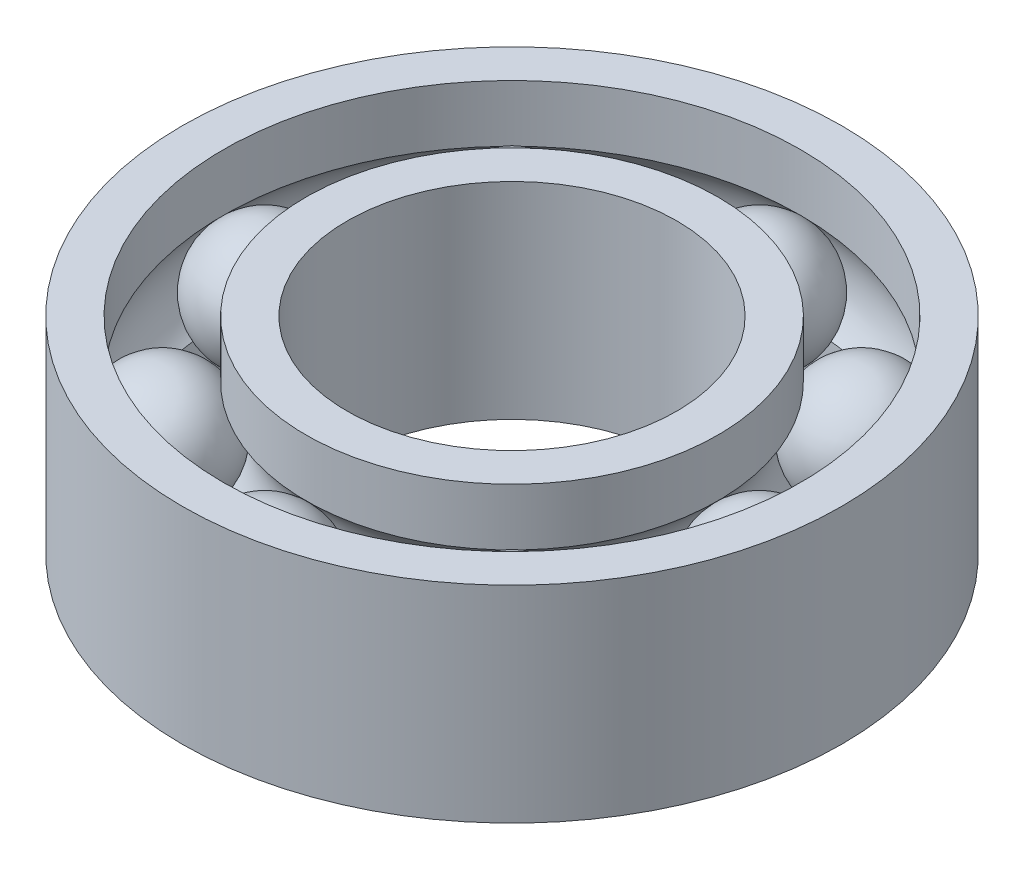
ISO-10303-21;
HEADER;
FILE_DESCRIPTION(('STEP AP214'),'2;1');
FILE_NAME('part.step','',(''),(''),'','','');
FILE_SCHEMA(('AUTOMOTIVE_DESIGN { 1 0 10303 214 1 1 1 1 }'));
ENDSEC;
DATA;
#1=APPLICATION_CONTEXT('core data for automotive mechanical design processes');
#2=APPLICATION_PROTOCOL_DEFINITION('international standard','automotive_design',2000,#1);
#3=PRODUCT_CONTEXT('',#1,'mechanical');
#4=PRODUCT('Part','Part','',(#3));
#5=PRODUCT_RELATED_PRODUCT_CATEGORY('part','',(#4));
#6=PRODUCT_DEFINITION_FORMATION('','',#4);
#7=PRODUCT_DEFINITION_CONTEXT('part definition',#1,'design');
#8=PRODUCT_DEFINITION('design','',#6,#7);
#9=PRODUCT_DEFINITION_SHAPE('','',#8);
#10=(LENGTH_UNIT() NAMED_UNIT(*) SI_UNIT(.MILLI.,.METRE.));
#11=(NAMED_UNIT(*) PLANE_ANGLE_UNIT() SI_UNIT($,.RADIAN.));
#12=(NAMED_UNIT(*) SI_UNIT($,.STERADIAN.) SOLID_ANGLE_UNIT());
#13=UNCERTAINTY_MEASURE_WITH_UNIT(LENGTH_MEASURE(1.E-05),#10,'distance_accuracy_value','');
#14=(GEOMETRIC_REPRESENTATION_CONTEXT(3) GLOBAL_UNCERTAINTY_ASSIGNED_CONTEXT((#13)) GLOBAL_UNIT_ASSIGNED_CONTEXT((#10,
#11,#12)) REPRESENTATION_CONTEXT('',''));
#15=CARTESIAN_POINT('',(0.,0.,0.));
#16=DIRECTION('',(0.,0.,1.));
#17=DIRECTION('',(1.,0.,0.));
#18=AXIS2_PLACEMENT_3D('',#15,#16,#17);
#19=CARTESIAN_POINT('',(-6.363961030679,0.,-6.36396103067885));
#20=DIRECTION('',(0.,1.,0.));
#21=DIRECTION('',(0.707106781186556,0.,0.707106781186539));
#22=AXIS2_PLACEMENT_3D('',#19,#20,#21);
#23=SPHERICAL_SURFACE('',#22,2.25);
#24=CARTESIAN_POINT('',(-6.363961030679,2.25000000000001,-6.36396103067885));
#25=VERTEX_POINT('',#24);
#26=VERTEX_LOOP('',#25);
#27=FACE_BOUND('',#26,.T.);
#28=ADVANCED_FACE('F42',(#27),#23,.T.);
#29=CLOSED_SHELL('',(#28));
#30=MANIFOLD_SOLID_BREP('B2',#29);
#31=CARTESIAN_POINT('',(0.,0.,-9.));
#32=DIRECTION('',(0.,1.,0.));
#33=DIRECTION('',(0.,0.,1.));
#34=AXIS2_PLACEMENT_3D('',#31,#32,#33);
#35=SPHERICAL_SURFACE('',#34,2.25);
#36=CARTESIAN_POINT('',(0.,2.25000000000001,-9.));
#37=VERTEX_POINT('',#36);
#38=VERTEX_LOOP('',#37);
#39=FACE_BOUND('',#38,.T.);
#40=ADVANCED_FACE('F61',(#39),#35,.T.);
#41=CLOSED_SHELL('',(#40));
#42=MANIFOLD_SOLID_BREP('B6',#41);
#43=CARTESIAN_POINT('',(6.36396103067887,0.,-6.36396103067898));
#44=DIRECTION('',(0.,1.,0.));
#45=DIRECTION('',(-0.707106781186541,0.,0.707106781186554));
#46=AXIS2_PLACEMENT_3D('',#43,#44,#45);
#47=SPHERICAL_SURFACE('',#46,2.25);
#48=CARTESIAN_POINT('',(6.36396103067887,2.25000000000001,-6.36396103067898));
#49=VERTEX_POINT('',#48);
#50=VERTEX_LOOP('',#49);
#51=FACE_BOUND('',#50,.T.);
#52=ADVANCED_FACE('F80',(#51),#47,.T.);
#53=CLOSED_SHELL('',(#52));
#54=MANIFOLD_SOLID_BREP('B38',#53);
#55=CARTESIAN_POINT('',(9.,0.,0.));
#56=DIRECTION('',(0.,1.,0.));
#57=DIRECTION('',(-1.,0.,0.));
#58=AXIS2_PLACEMENT_3D('',#55,#56,#57);
#59=SPHERICAL_SURFACE('',#58,2.25);
#60=CARTESIAN_POINT('',(9.,2.25000000000001,0.));
#61=VERTEX_POINT('',#60);
#62=VERTEX_LOOP('',#61);
#63=FACE_BOUND('',#62,.T.);
#64=ADVANCED_FACE('F99',(#63),#59,.T.);
#65=CLOSED_SHELL('',(#64));
#66=MANIFOLD_SOLID_BREP('B57',#65);
#67=CARTESIAN_POINT('',(6.36396103067896,0.,6.36396103067889));
#68=DIRECTION('',(0.,1.,0.));
#69=DIRECTION('',(-0.707106781186551,0.,-0.707106781186544));
#70=AXIS2_PLACEMENT_3D('',#67,#68,#69);
#71=SPHERICAL_SURFACE('',#70,2.25);
#72=CARTESIAN_POINT('',(6.36396103067896,2.25000000000001,6.36396103067889));
#73=VERTEX_POINT('',#72);
#74=VERTEX_LOOP('',#73);
#75=FACE_BOUND('',#74,.T.);
#76=ADVANCED_FACE('F118',(#75),#71,.T.);
#77=CLOSED_SHELL('',(#76));
#78=MANIFOLD_SOLID_BREP('B76',#77);
#79=CARTESIAN_POINT('',(0.,0.,9.));
#80=DIRECTION('',(0.,1.,0.));
#81=DIRECTION('',(0.,0.,-1.));
#82=AXIS2_PLACEMENT_3D('',#79,#80,#81);
#83=SPHERICAL_SURFACE('',#82,2.25);
#84=CARTESIAN_POINT('',(0.,2.25000000000001,9.));
#85=VERTEX_POINT('',#84);
#86=VERTEX_LOOP('',#85);
#87=FACE_BOUND('',#86,.T.);
#88=ADVANCED_FACE('F137',(#87),#83,.T.);
#89=CLOSED_SHELL('',(#88));
#90=MANIFOLD_SOLID_BREP('B95',#89);
#91=CARTESIAN_POINT('',(-6.36396103067892,0.,6.36396103067894));
#92=DIRECTION('',(0.,1.,0.));
#93=DIRECTION('',(0.707106781186546,0.,-0.707106781186549));
#94=AXIS2_PLACEMENT_3D('',#91,#92,#93);
#95=SPHERICAL_SURFACE('',#94,2.25);
#96=CARTESIAN_POINT('',(-6.36396103067892,2.25000000000001,6.36396103067894));
#97=VERTEX_POINT('',#96);
#98=VERTEX_LOOP('',#97);
#99=FACE_BOUND('',#98,.T.);
#100=ADVANCED_FACE('F158',(#99),#95,.T.);
#101=CLOSED_SHELL('',(#100));
#102=MANIFOLD_SOLID_BREP('B114',#101);
#103=CARTESIAN_POINT('',(0.,-4.125,0.));
#104=DIRECTION('',(0.,-1.,0.));
#105=DIRECTION('',(0.,0.,-1.));
#106=AXIS2_PLACEMENT_3D('',#103,#104,#105);
#107=CYLINDRICAL_SURFACE('',#106,10.5);
#108=CARTESIAN_POINT('',(0.,-1.67705098312483,0.));
#109=DIRECTION('',(0.,-1.,0.));
#110=DIRECTION('',(0.,0.,-1.));
#111=AXIS2_PLACEMENT_3D('',#108,#109,#110);
#112=CIRCLE('',#111,10.5);
#113=CARTESIAN_POINT('',(0.,-1.67705098312483,-10.5));
#114=VERTEX_POINT('',#113);
#115=EDGE_CURVE('E157',#114,#114,#112,.T.);
#116=ORIENTED_EDGE('',*,*,#115,.F.);
#117=EDGE_LOOP('',(#116));
#118=FACE_BOUND('',#117,.T.);
#119=CARTESIAN_POINT('',(0.,-3.74999999999999,0.));
#120=DIRECTION('',(0.,-1.,0.));
#121=DIRECTION('',(0.,0.,-1.));
#122=AXIS2_PLACEMENT_3D('',#119,#120,#121);
#123=CIRCLE('',#122,10.5);
#124=CARTESIAN_POINT('',(0.,-3.74999999999999,-10.5));
#125=VERTEX_POINT('',#124);
#126=EDGE_CURVE('E206',#125,#125,#123,.T.);
#127=ORIENTED_EDGE('',*,*,#126,.T.);
#128=EDGE_LOOP('',(#127));
#129=FACE_BOUND('',#128,.T.);
#130=ADVANCED_FACE('F179',(#118,#129),#107,.F.);
#131=CARTESIAN_POINT('',(0.,0.,0.));
#132=DIRECTION('',(0.,-1.,0.));
#133=DIRECTION('',(0.,0.,-1.));
#134=AXIS2_PLACEMENT_3D('',#131,#132,#133);
#135=TOROIDAL_SURFACE('',#134,9.,2.25);
#136=CARTESIAN_POINT('',(0.,1.67705098312485,0.));
#137=DIRECTION('',(0.,-1.,0.));
#138=DIRECTION('',(0.,0.,-1.));
#139=AXIS2_PLACEMENT_3D('',#136,#137,#138);
#140=CIRCLE('',#139,10.5);
#141=CARTESIAN_POINT('',(0.,1.67705098312485,-10.5));
#142=VERTEX_POINT('',#141);
#143=EDGE_CURVE('E186',#142,#142,#140,.T.);
#144=ORIENTED_EDGE('',*,*,#143,.F.);
#145=EDGE_LOOP('',(#144));
#146=FACE_BOUND('',#145,.T.);
#147=ORIENTED_EDGE('',*,*,#115,.T.);
#148=EDGE_LOOP('',(#147));
#149=FACE_BOUND('',#148,.T.);
#150=ADVANCED_FACE('F232',(#146,#149),#135,.F.);
#151=CARTESIAN_POINT('',(0.,-4.125,0.));
#152=DIRECTION('',(0.,-1.,0.));
#153=DIRECTION('',(0.,0.,-1.));
#154=AXIS2_PLACEMENT_3D('',#151,#152,#153);
#155=CYLINDRICAL_SURFACE('',#154,10.5);
#156=CARTESIAN_POINT('',(0.,3.75000000000001,0.));
#157=DIRECTION('',(0.,-1.,0.));
#158=DIRECTION('',(0.,0.,-1.));
#159=AXIS2_PLACEMENT_3D('',#156,#157,#158);
#160=CIRCLE('',#159,10.5);
#161=CARTESIAN_POINT('',(0.,3.75000000000001,-10.5));
#162=VERTEX_POINT('',#161);
#163=EDGE_CURVE('E191',#162,#162,#160,.T.);
#164=ORIENTED_EDGE('',*,*,#163,.F.);
#165=EDGE_LOOP('',(#164));
#166=FACE_BOUND('',#165,.T.);
#167=ORIENTED_EDGE('',*,*,#143,.T.);
#168=EDGE_LOOP('',(#167));
#169=FACE_BOUND('',#168,.T.);
#170=ADVANCED_FACE('F227',(#166,#169),#155,.F.);
#171=CARTESIAN_POINT('',(-12.,3.75000000000001,0.));
#172=DIRECTION('',(0.,-1.,0.));
#173=DIRECTION('',(0.,0.,-1.));
#174=AXIS2_PLACEMENT_3D('',#171,#172,#173);
#175=PLANE('',#174);
#176=CARTESIAN_POINT('',(0.,3.75000000000001,0.));
#177=DIRECTION('',(0.,-1.,0.));
#178=DIRECTION('',(0.,0.,-1.));
#179=AXIS2_PLACEMENT_3D('',#176,#177,#178);
#180=CIRCLE('',#179,12.);
#181=CARTESIAN_POINT('',(0.,3.75000000000001,-12.));
#182=VERTEX_POINT('',#181);
#183=EDGE_CURVE('E196',#182,#182,#180,.T.);
#184=ORIENTED_EDGE('',*,*,#183,.F.);
#185=EDGE_LOOP('',(#184));
#186=FACE_BOUND('',#185,.T.);
#187=ORIENTED_EDGE('',*,*,#163,.T.);
#188=EDGE_LOOP('',(#187));
#189=FACE_BOUND('',#188,.T.);
#190=ADVANCED_FACE('F221',(#186,#189),#175,.F.);
#191=CARTESIAN_POINT('',(0.,-4.125,0.));
#192=DIRECTION('',(0.,-1.,0.));
#193=DIRECTION('',(0.,0.,-1.));
#194=AXIS2_PLACEMENT_3D('',#191,#192,#193);
#195=CYLINDRICAL_SURFACE('',#194,12.);
#196=CARTESIAN_POINT('',(0.,-3.74999999999999,0.));
#197=DIRECTION('',(0.,-1.,0.));
#198=DIRECTION('',(0.,0.,-1.));
#199=AXIS2_PLACEMENT_3D('',#196,#197,#198);
#200=CIRCLE('',#199,12.);
#201=CARTESIAN_POINT('',(0.,-3.74999999999999,-12.));
#202=VERTEX_POINT('',#201);
#203=EDGE_CURVE('E202',#202,#202,#200,.T.);
#204=ORIENTED_EDGE('',*,*,#203,.F.);
#205=EDGE_LOOP('',(#204));
#206=FACE_BOUND('',#205,.T.);
#207=ORIENTED_EDGE('',*,*,#183,.T.);
#208=EDGE_LOOP('',(#207));
#209=FACE_BOUND('',#208,.T.);
#210=ADVANCED_FACE('F215',(#206,#209),#195,.T.);
#211=CARTESIAN_POINT('',(-12.,-3.74999999999999,0.));
#212=DIRECTION('',(0.,1.,0.));
#213=DIRECTION('',(0.,0.,1.));
#214=AXIS2_PLACEMENT_3D('',#211,#212,#213);
#215=PLANE('',#214);
#216=ORIENTED_EDGE('',*,*,#126,.F.);
#217=EDGE_LOOP('',(#216));
#218=FACE_BOUND('',#217,.T.);
#219=ORIENTED_EDGE('',*,*,#203,.T.);
#220=EDGE_LOOP('',(#219));
#221=FACE_BOUND('',#220,.T.);
#222=ADVANCED_FACE('F212',(#218,#221),#215,.F.);
#223=CLOSED_SHELL('',(#130,#150,#170,#190,#210,#222));
#224=MANIFOLD_SOLID_BREP('B133',#223);
#225=CARTESIAN_POINT('',(0.,-4.125,0.));
#226=DIRECTION('',(0.,-1.,0.));
#227=DIRECTION('',(0.,0.,-1.));
#228=AXIS2_PLACEMENT_3D('',#225,#226,#227);
#229=CYLINDRICAL_SURFACE('',#228,6.);
#230=CARTESIAN_POINT('',(0.,3.75,0.));
#231=DIRECTION('',(0.,-1.,0.));
#232=DIRECTION('',(0.,0.,-1.));
#233=AXIS2_PLACEMENT_3D('',#230,#231,#232);
#234=CIRCLE('',#233,6.);
#235=CARTESIAN_POINT('',(0.,3.75,-6.));
#236=VERTEX_POINT('',#235);
#237=EDGE_CURVE('E178',#236,#236,#234,.T.);
#238=ORIENTED_EDGE('',*,*,#237,.F.);
#239=EDGE_LOOP('',(#238));
#240=FACE_BOUND('',#239,.T.);
#241=CARTESIAN_POINT('',(0.,-3.75,0.));
#242=DIRECTION('',(0.,-1.,0.));
#243=DIRECTION('',(0.,0.,-1.));
#244=AXIS2_PLACEMENT_3D('',#241,#242,#243);
#245=CIRCLE('',#244,6.);
#246=CARTESIAN_POINT('',(0.,-3.75,-6.));
#247=VERTEX_POINT('',#246);
#248=EDGE_CURVE('E304',#247,#247,#245,.T.);
#249=ORIENTED_EDGE('',*,*,#248,.T.);
#250=EDGE_LOOP('',(#249));
#251=FACE_BOUND('',#250,.T.);
#252=ADVANCED_FACE('F282',(#240,#251),#229,.F.);
#253=CARTESIAN_POINT('',(-7.5,3.75,0.));
#254=DIRECTION('',(0.,-1.,0.));
#255=DIRECTION('',(0.,0.,-1.));
#256=AXIS2_PLACEMENT_3D('',#253,#254,#255);
#257=PLANE('',#256);
#258=CARTESIAN_POINT('',(0.,3.75,0.));
#259=DIRECTION('',(0.,-1.,0.));
#260=DIRECTION('',(0.,0.,-1.));
#261=AXIS2_PLACEMENT_3D('',#258,#259,#260);
#262=CIRCLE('',#261,7.5);
#263=CARTESIAN_POINT('',(0.,3.75,-7.5));
#264=VERTEX_POINT('',#263);
#265=EDGE_CURVE('E288',#264,#264,#262,.T.);
#266=ORIENTED_EDGE('',*,*,#265,.F.);
#267=EDGE_LOOP('',(#266));
#268=FACE_BOUND('',#267,.T.);
#269=ORIENTED_EDGE('',*,*,#237,.T.);
#270=EDGE_LOOP('',(#269));
#271=FACE_BOUND('',#270,.T.);
#272=ADVANCED_FACE('F329',(#268,#271),#257,.F.);
#273=CARTESIAN_POINT('',(0.,-4.125,0.));
#274=DIRECTION('',(0.,-1.,0.));
#275=DIRECTION('',(0.,0.,-1.));
#276=AXIS2_PLACEMENT_3D('',#273,#274,#275);
#277=CYLINDRICAL_SURFACE('',#276,7.5);
#278=CARTESIAN_POINT('',(0.,1.67705098312485,0.));
#279=DIRECTION('',(0.,-1.,0.));
#280=DIRECTION('',(0.,0.,-1.));
#281=AXIS2_PLACEMENT_3D('',#278,#279,#280);
#282=CIRCLE('',#281,7.5);
#283=CARTESIAN_POINT('',(0.,1.67705098312485,-7.5));
#284=VERTEX_POINT('',#283);
#285=EDGE_CURVE('E292',#284,#284,#282,.T.);
#286=ORIENTED_EDGE('',*,*,#285,.F.);
#287=EDGE_LOOP('',(#286));
#288=FACE_BOUND('',#287,.T.);
#289=ORIENTED_EDGE('',*,*,#265,.T.);
#290=EDGE_LOOP('',(#289));
#291=FACE_BOUND('',#290,.T.);
#292=ADVANCED_FACE('F324',(#288,#291),#277,.T.);
#293=CARTESIAN_POINT('',(0.,0.,0.));
#294=DIRECTION('',(0.,-1.,0.));
#295=DIRECTION('',(0.,0.,-1.));
#296=AXIS2_PLACEMENT_3D('',#293,#294,#295);
#297=TOROIDAL_SURFACE('',#296,9.,2.25);
#298=CARTESIAN_POINT('',(0.,-1.67705098312484,0.));
#299=DIRECTION('',(0.,-1.,0.));
#300=DIRECTION('',(0.,0.,-1.));
#301=AXIS2_PLACEMENT_3D('',#298,#299,#300);
#302=CIRCLE('',#301,7.5);
#303=CARTESIAN_POINT('',(0.,-1.67705098312484,-7.5));
#304=VERTEX_POINT('',#303);
#305=EDGE_CURVE('E296',#304,#304,#302,.T.);
#306=ORIENTED_EDGE('',*,*,#305,.F.);
#307=EDGE_LOOP('',(#306));
#308=FACE_BOUND('',#307,.T.);
#309=ORIENTED_EDGE('',*,*,#285,.T.);
#310=EDGE_LOOP('',(#309));
#311=FACE_BOUND('',#310,.T.);
#312=ADVANCED_FACE('F318',(#308,#311),#297,.F.);
#313=CARTESIAN_POINT('',(0.,-4.125,0.));
#314=DIRECTION('',(0.,-1.,0.));
#315=DIRECTION('',(0.,0.,-1.));
#316=AXIS2_PLACEMENT_3D('',#313,#314,#315);
#317=CYLINDRICAL_SURFACE('',#316,7.5);
#318=CARTESIAN_POINT('',(0.,-3.75,0.));
#319=DIRECTION('',(0.,-1.,0.));
#320=DIRECTION('',(0.,0.,-1.));
#321=AXIS2_PLACEMENT_3D('',#318,#319,#320);
#322=CIRCLE('',#321,7.5);
#323=CARTESIAN_POINT('',(0.,-3.75,-7.5));
#324=VERTEX_POINT('',#323);
#325=EDGE_CURVE('E301',#324,#324,#322,.T.);
#326=ORIENTED_EDGE('',*,*,#325,.F.);
#327=EDGE_LOOP('',(#326));
#328=FACE_BOUND('',#327,.T.);
#329=ORIENTED_EDGE('',*,*,#305,.T.);
#330=EDGE_LOOP('',(#329));
#331=FACE_BOUND('',#330,.T.);
#332=ADVANCED_FACE('F312',(#328,#331),#317,.T.);
#333=CARTESIAN_POINT('',(-7.5,-3.75,0.));
#334=DIRECTION('',(0.,1.,0.));
#335=DIRECTION('',(0.,0.,1.));
#336=AXIS2_PLACEMENT_3D('',#333,#334,#335);
#337=PLANE('',#336);
#338=ORIENTED_EDGE('',*,*,#248,.F.);
#339=EDGE_LOOP('',(#338));
#340=FACE_BOUND('',#339,.T.);
#341=ORIENTED_EDGE('',*,*,#325,.T.);
#342=EDGE_LOOP('',(#341));
#343=FACE_BOUND('',#342,.T.);
#344=ADVANCED_FACE('F309',(#340,#343),#337,.F.);
#345=CLOSED_SHELL('',(#252,#272,#292,#312,#332,#344));
#346=MANIFOLD_SOLID_BREP('B152',#345);
#347=CARTESIAN_POINT('',(-9.,0.,0.));
#348=DIRECTION('',(0.,1.,0.));
#349=DIRECTION('',(1.,0.,0.));
#350=AXIS2_PLACEMENT_3D('',#347,#348,#349);
#351=SPHERICAL_SURFACE('',#350,2.25);
#352=CARTESIAN_POINT('',(-9.,2.25000000000001,0.));
#353=VERTEX_POINT('',#352);
#354=VERTEX_LOOP('',#353);
#355=FACE_BOUND('',#354,.T.);
#356=ADVANCED_FACE('F374',(#355),#351,.T.);
#357=CLOSED_SHELL('',(#356));
#358=MANIFOLD_SOLID_BREP('B173',#357);
#359=ADVANCED_BREP_SHAPE_REPRESENTATION('',(#18,#30,#42,#54,#66,#78,#90,#102,#224,#346,#358),#14);
#360=SHAPE_DEFINITION_REPRESENTATION(#9,#359);
ENDSEC;
END-ISO-10303-21;
